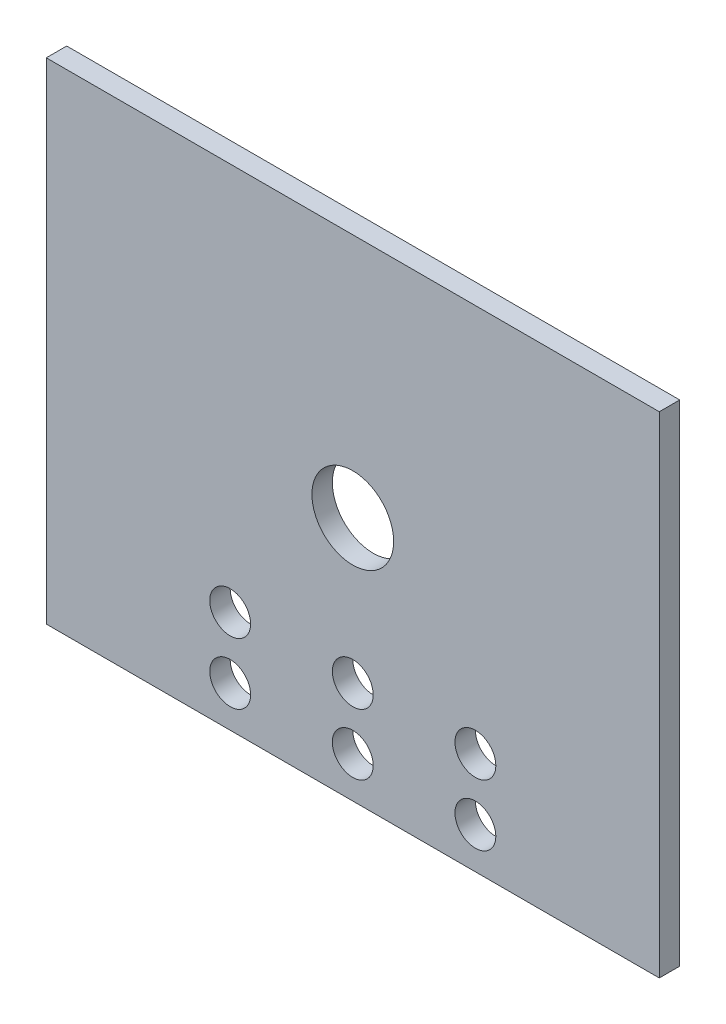
ISO-10303-21;
HEADER;
FILE_DESCRIPTION(('STEP AP214'),'2;1');
FILE_NAME('part.step','',(''),(''),'','','');
FILE_SCHEMA(('AUTOMOTIVE_DESIGN { 1 0 10303 214 1 1 1 1 }'));
ENDSEC;
DATA;
#1=APPLICATION_CONTEXT('core data for automotive mechanical design processes');
#2=APPLICATION_PROTOCOL_DEFINITION('international standard','automotive_design',2000,#1);
#3=PRODUCT_CONTEXT('',#1,'mechanical');
#4=PRODUCT('Part','Part','',(#3));
#5=PRODUCT_RELATED_PRODUCT_CATEGORY('part','',(#4));
#6=PRODUCT_DEFINITION_FORMATION('','',#4);
#7=PRODUCT_DEFINITION_CONTEXT('part definition',#1,'design');
#8=PRODUCT_DEFINITION('design','',#6,#7);
#9=PRODUCT_DEFINITION_SHAPE('','',#8);
#10=(LENGTH_UNIT() NAMED_UNIT(*) SI_UNIT(.MILLI.,.METRE.));
#11=(NAMED_UNIT(*) PLANE_ANGLE_UNIT() SI_UNIT($,.RADIAN.));
#12=(NAMED_UNIT(*) SI_UNIT($,.STERADIAN.) SOLID_ANGLE_UNIT());
#13=UNCERTAINTY_MEASURE_WITH_UNIT(LENGTH_MEASURE(1.E-05),#10,'distance_accuracy_value','');
#14=(GEOMETRIC_REPRESENTATION_CONTEXT(3) GLOBAL_UNCERTAINTY_ASSIGNED_CONTEXT((#13)) GLOBAL_UNIT_ASSIGNED_CONTEXT((#10,
#11,#12)) REPRESENTATION_CONTEXT('',''));
#15=CARTESIAN_POINT('',(0.,0.,0.));
#16=DIRECTION('',(0.,0.,1.));
#17=DIRECTION('',(1.,0.,0.));
#18=AXIS2_PLACEMENT_3D('',#15,#16,#17);
#19=CARTESIAN_POINT('',(0.,0.,5.));
#20=DIRECTION('',(1.,0.,0.));
#21=DIRECTION('',(0.,0.,-1.));
#22=AXIS2_PLACEMENT_3D('',#19,#20,#21);
#23=PLANE('',#22);
#24=DIRECTION('',(0.,-1.,0.));
#25=VECTOR('',#24,1.);
#26=CARTESIAN_POINT('',(0.,0.,0.));
#27=LINE('',#26,#25);
#28=CARTESIAN_POINT('',(0.,120.,0.));
#29=VERTEX_POINT('',#28);
#30=CARTESIAN_POINT('',(0.,0.,0.));
#31=VERTEX_POINT('',#30);
#32=EDGE_CURVE('E398',#29,#31,#27,.T.);
#33=ORIENTED_EDGE('',*,*,#32,.T.);
#34=DIRECTION('',(0.,0.,-1.));
#35=VECTOR('',#34,1.);
#36=CARTESIAN_POINT('',(0.,0.,5.));
#37=LINE('',#36,#35);
#38=CARTESIAN_POINT('',(0.,0.,5.));
#39=VERTEX_POINT('',#38);
#40=EDGE_CURVE('E405',#39,#31,#37,.T.);
#41=ORIENTED_EDGE('',*,*,#40,.F.);
#42=DIRECTION('',(0.,-1.,0.));
#43=VECTOR('',#42,1.);
#44=CARTESIAN_POINT('',(0.,0.,5.));
#45=LINE('',#44,#43);
#46=CARTESIAN_POINT('',(0.,120.,5.));
#47=VERTEX_POINT('',#46);
#48=EDGE_CURVE('E425',#47,#39,#45,.T.);
#49=ORIENTED_EDGE('',*,*,#48,.F.);
#50=DIRECTION('',(0.,0.,-1.));
#51=VECTOR('',#50,1.);
#52=CARTESIAN_POINT('',(0.,120.,5.));
#53=LINE('',#52,#51);
#54=EDGE_CURVE('E413',#47,#29,#53,.T.);
#55=ORIENTED_EDGE('',*,*,#54,.T.);
#56=EDGE_LOOP('',(#33,#41,#49,#55));
#57=FACE_BOUND('',#56,.T.);
#58=ADVANCED_FACE('F349',(#57),#23,.F.);
#59=CARTESIAN_POINT('',(0.,0.,5.));
#60=DIRECTION('',(0.,1.,0.));
#61=DIRECTION('',(0.,0.,1.));
#62=AXIS2_PLACEMENT_3D('',#59,#60,#61);
#63=PLANE('',#62);
#64=DIRECTION('',(1.,0.,0.));
#65=VECTOR('',#64,1.);
#66=CARTESIAN_POINT('',(0.,0.,0.));
#67=LINE('',#66,#65);
#68=CARTESIAN_POINT('',(150.,0.,0.));
#69=VERTEX_POINT('',#68);
#70=EDGE_CURVE('E392',#31,#69,#67,.T.);
#71=ORIENTED_EDGE('',*,*,#70,.T.);
#72=DIRECTION('',(0.,0.,-1.));
#73=VECTOR('',#72,1.);
#74=CARTESIAN_POINT('',(150.,0.,5.));
#75=LINE('',#74,#73);
#76=CARTESIAN_POINT('',(150.,0.,5.));
#77=VERTEX_POINT('',#76);
#78=EDGE_CURVE('E410',#77,#69,#75,.T.);
#79=ORIENTED_EDGE('',*,*,#78,.F.);
#80=DIRECTION('',(1.,0.,0.));
#81=VECTOR('',#80,1.);
#82=CARTESIAN_POINT('',(0.,0.,5.));
#83=LINE('',#82,#81);
#84=EDGE_CURVE('E407',#39,#77,#83,.T.);
#85=ORIENTED_EDGE('',*,*,#84,.F.);
#86=ORIENTED_EDGE('',*,*,#40,.T.);
#87=EDGE_LOOP('',(#71,#79,#85,#86));
#88=FACE_BOUND('',#87,.T.);
#89=ADVANCED_FACE('F406',(#88),#63,.F.);
#90=CARTESIAN_POINT('',(150.,0.,5.));
#91=DIRECTION('',(-1.,0.,0.));
#92=DIRECTION('',(0.,0.,1.));
#93=AXIS2_PLACEMENT_3D('',#90,#91,#92);
#94=PLANE('',#93);
#95=DIRECTION('',(0.,1.,0.));
#96=VECTOR('',#95,1.);
#97=CARTESIAN_POINT('',(150.,0.,0.));
#98=LINE('',#97,#96);
#99=CARTESIAN_POINT('',(150.,120.,0.));
#100=VERTEX_POINT('',#99);
#101=EDGE_CURVE('E399',#69,#100,#98,.T.);
#102=ORIENTED_EDGE('',*,*,#101,.T.);
#103=DIRECTION('',(0.,0.,-1.));
#104=VECTOR('',#103,1.);
#105=CARTESIAN_POINT('',(150.,120.,5.));
#106=LINE('',#105,#104);
#107=CARTESIAN_POINT('',(150.,120.,5.));
#108=VERTEX_POINT('',#107);
#109=EDGE_CURVE('E431',#108,#100,#106,.T.);
#110=ORIENTED_EDGE('',*,*,#109,.F.);
#111=DIRECTION('',(0.,1.,0.));
#112=VECTOR('',#111,1.);
#113=CARTESIAN_POINT('',(150.,0.,5.));
#114=LINE('',#113,#112);
#115=EDGE_CURVE('E371',#77,#108,#114,.T.);
#116=ORIENTED_EDGE('',*,*,#115,.F.);
#117=ORIENTED_EDGE('',*,*,#78,.T.);
#118=EDGE_LOOP('',(#102,#110,#116,#117));
#119=FACE_BOUND('',#118,.T.);
#120=ADVANCED_FACE('F497',(#119),#94,.F.);
#121=CARTESIAN_POINT('',(0.,120.,5.));
#122=DIRECTION('',(0.,-1.,0.));
#123=DIRECTION('',(0.,0.,-1.));
#124=AXIS2_PLACEMENT_3D('',#121,#122,#123);
#125=PLANE('',#124);
#126=DIRECTION('',(-1.,0.,0.));
#127=VECTOR('',#126,1.);
#128=CARTESIAN_POINT('',(0.,120.,0.));
#129=LINE('',#128,#127);
#130=EDGE_CURVE('E423',#100,#29,#129,.T.);
#131=ORIENTED_EDGE('',*,*,#130,.T.);
#132=ORIENTED_EDGE('',*,*,#54,.F.);
#133=DIRECTION('',(-1.,0.,0.));
#134=VECTOR('',#133,1.);
#135=CARTESIAN_POINT('',(0.,120.,5.));
#136=LINE('',#135,#134);
#137=EDGE_CURVE('E366',#108,#47,#136,.T.);
#138=ORIENTED_EDGE('',*,*,#137,.F.);
#139=ORIENTED_EDGE('',*,*,#109,.T.);
#140=EDGE_LOOP('',(#131,#132,#138,#139));
#141=FACE_BOUND('',#140,.T.);
#142=ADVANCED_FACE('F472',(#141),#125,.F.);
#143=CARTESIAN_POINT('',(0.,120.,5.));
#144=DIRECTION('',(0.,0.,-1.));
#145=DIRECTION('',(-1.,0.,0.));
#146=AXIS2_PLACEMENT_3D('',#143,#144,#145);
#147=PLANE('',#146);
#148=CARTESIAN_POINT('',(105.,25.,5.));
#149=DIRECTION('',(0.,0.,1.));
#150=DIRECTION('',(1.,0.,0.));
#151=AXIS2_PLACEMENT_3D('',#148,#149,#150);
#152=CIRCLE('',#151,5.);
#153=CARTESIAN_POINT('',(110.,25.,5.));
#154=VERTEX_POINT('',#153);
#155=EDGE_CURVE('E457',#154,#154,#152,.T.);
#156=ORIENTED_EDGE('',*,*,#155,.F.);
#157=EDGE_LOOP('',(#156));
#158=FACE_BOUND('',#157,.T.);
#159=CARTESIAN_POINT('',(75.,25.,5.));
#160=DIRECTION('',(0.,0.,1.));
#161=DIRECTION('',(1.,0.,0.));
#162=AXIS2_PLACEMENT_3D('',#159,#160,#161);
#163=CIRCLE('',#162,5.);
#164=CARTESIAN_POINT('',(80.,25.,5.));
#165=VERTEX_POINT('',#164);
#166=EDGE_CURVE('E447',#165,#165,#163,.T.);
#167=ORIENTED_EDGE('',*,*,#166,.F.);
#168=EDGE_LOOP('',(#167));
#169=FACE_BOUND('',#168,.T.);
#170=CARTESIAN_POINT('',(45.,25.,5.));
#171=DIRECTION('',(0.,0.,1.));
#172=DIRECTION('',(1.,0.,0.));
#173=AXIS2_PLACEMENT_3D('',#170,#171,#172);
#174=CIRCLE('',#173,5.);
#175=CARTESIAN_POINT('',(50.,25.,5.));
#176=VERTEX_POINT('',#175);
#177=EDGE_CURVE('E444',#176,#176,#174,.T.);
#178=ORIENTED_EDGE('',*,*,#177,.F.);
#179=EDGE_LOOP('',(#178));
#180=FACE_BOUND('',#179,.T.);
#181=CARTESIAN_POINT('',(75.,9.99999999999999,5.));
#182=DIRECTION('',(0.,0.,1.));
#183=DIRECTION('',(1.,0.,0.));
#184=AXIS2_PLACEMENT_3D('',#181,#182,#183);
#185=CIRCLE('',#184,5.);
#186=CARTESIAN_POINT('',(80.,9.99999999999999,5.));
#187=VERTEX_POINT('',#186);
#188=EDGE_CURVE('E462',#187,#187,#185,.T.);
#189=ORIENTED_EDGE('',*,*,#188,.F.);
#190=EDGE_LOOP('',(#189));
#191=FACE_BOUND('',#190,.T.);
#192=CARTESIAN_POINT('',(45.,9.99999999999999,5.));
#193=DIRECTION('',(0.,0.,1.));
#194=DIRECTION('',(1.,0.,0.));
#195=AXIS2_PLACEMENT_3D('',#192,#193,#194);
#196=CIRCLE('',#195,5.);
#197=CARTESIAN_POINT('',(50.,9.99999999999999,5.));
#198=VERTEX_POINT('',#197);
#199=EDGE_CURVE('E438',#198,#198,#196,.T.);
#200=ORIENTED_EDGE('',*,*,#199,.F.);
#201=EDGE_LOOP('',(#200));
#202=FACE_BOUND('',#201,.T.);
#203=CARTESIAN_POINT('',(75.,60.,5.));
#204=DIRECTION('',(0.,0.,1.));
#205=DIRECTION('',(1.,0.,0.));
#206=AXIS2_PLACEMENT_3D('',#203,#204,#205);
#207=CIRCLE('',#206,9.99999999999999);
#208=CARTESIAN_POINT('',(85.,60.,5.));
#209=VERTEX_POINT('',#208);
#210=EDGE_CURVE('E417',#209,#209,#207,.T.);
#211=ORIENTED_EDGE('',*,*,#210,.F.);
#212=EDGE_LOOP('',(#211));
#213=FACE_BOUND('',#212,.T.);
#214=ORIENTED_EDGE('',*,*,#48,.T.);
#215=ORIENTED_EDGE('',*,*,#84,.T.);
#216=ORIENTED_EDGE('',*,*,#115,.T.);
#217=ORIENTED_EDGE('',*,*,#137,.T.);
#218=EDGE_LOOP('',(#214,#215,#216,#217));
#219=FACE_BOUND('',#218,.T.);
#220=CARTESIAN_POINT('',(105.,9.99999999999999,5.));
#221=DIRECTION('',(0.,0.,1.));
#222=DIRECTION('',(1.,0.,0.));
#223=AXIS2_PLACEMENT_3D('',#220,#221,#222);
#224=CIRCLE('',#223,5.);
#225=CARTESIAN_POINT('',(110.,9.99999999999999,5.));
#226=VERTEX_POINT('',#225);
#227=EDGE_CURVE('E11',#226,#226,#224,.T.);
#228=ORIENTED_EDGE('',*,*,#227,.F.);
#229=EDGE_LOOP('',(#228));
#230=FACE_BOUND('',#229,.T.);
#231=ADVANCED_FACE('F469',(#158,#169,#180,#191,#202,#213,#219,#230),#147,.F.);
#232=CARTESIAN_POINT('',(0.,120.,0.));
#233=DIRECTION('',(0.,0.,-1.));
#234=DIRECTION('',(-1.,0.,0.));
#235=AXIS2_PLACEMENT_3D('',#232,#233,#234);
#236=PLANE('',#235);
#237=CARTESIAN_POINT('',(105.,25.,0.));
#238=DIRECTION('',(0.,0.,-1.));
#239=DIRECTION('',(-1.,0.,0.));
#240=AXIS2_PLACEMENT_3D('',#237,#238,#239);
#241=CIRCLE('',#240,5.);
#242=CARTESIAN_POINT('',(100.,25.,0.));
#243=VERTEX_POINT('',#242);
#244=EDGE_CURVE('E353',#243,#243,#241,.T.);
#245=ORIENTED_EDGE('',*,*,#244,.F.);
#246=EDGE_LOOP('',(#245));
#247=FACE_BOUND('',#246,.T.);
#248=CARTESIAN_POINT('',(75.,25.,0.));
#249=DIRECTION('',(0.,0.,-1.));
#250=DIRECTION('',(-1.,0.,0.));
#251=AXIS2_PLACEMENT_3D('',#248,#249,#250);
#252=CIRCLE('',#251,5.);
#253=CARTESIAN_POINT('',(70.,25.,0.));
#254=VERTEX_POINT('',#253);
#255=EDGE_CURVE('E445',#254,#254,#252,.T.);
#256=ORIENTED_EDGE('',*,*,#255,.F.);
#257=EDGE_LOOP('',(#256));
#258=FACE_BOUND('',#257,.T.);
#259=CARTESIAN_POINT('',(45.,25.,0.));
#260=DIRECTION('',(0.,0.,-1.));
#261=DIRECTION('',(-1.,0.,0.));
#262=AXIS2_PLACEMENT_3D('',#259,#260,#261);
#263=CIRCLE('',#262,5.);
#264=CARTESIAN_POINT('',(40.,25.,0.));
#265=VERTEX_POINT('',#264);
#266=EDGE_CURVE('E441',#265,#265,#263,.T.);
#267=ORIENTED_EDGE('',*,*,#266,.F.);
#268=EDGE_LOOP('',(#267));
#269=FACE_BOUND('',#268,.T.);
#270=CARTESIAN_POINT('',(75.,9.99999999999999,0.));
#271=DIRECTION('',(0.,0.,-1.));
#272=DIRECTION('',(-1.,0.,0.));
#273=AXIS2_PLACEMENT_3D('',#270,#271,#272);
#274=CIRCLE('',#273,5.);
#275=CARTESIAN_POINT('',(70.,9.99999999999999,0.));
#276=VERTEX_POINT('',#275);
#277=EDGE_CURVE('E443',#276,#276,#274,.T.);
#278=ORIENTED_EDGE('',*,*,#277,.F.);
#279=EDGE_LOOP('',(#278));
#280=FACE_BOUND('',#279,.T.);
#281=CARTESIAN_POINT('',(45.,9.99999999999999,0.));
#282=DIRECTION('',(0.,0.,-1.));
#283=DIRECTION('',(-1.,0.,0.));
#284=AXIS2_PLACEMENT_3D('',#281,#282,#283);
#285=CIRCLE('',#284,5.);
#286=CARTESIAN_POINT('',(40.,9.99999999999999,0.));
#287=VERTEX_POINT('',#286);
#288=EDGE_CURVE('E435',#287,#287,#285,.T.);
#289=ORIENTED_EDGE('',*,*,#288,.F.);
#290=EDGE_LOOP('',(#289));
#291=FACE_BOUND('',#290,.T.);
#292=CARTESIAN_POINT('',(75.,60.,0.));
#293=DIRECTION('',(0.,0.,-1.));
#294=DIRECTION('',(-1.,0.,0.));
#295=AXIS2_PLACEMENT_3D('',#292,#293,#294);
#296=CIRCLE('',#295,9.99999999999999);
#297=CARTESIAN_POINT('',(65.,60.,0.));
#298=VERTEX_POINT('',#297);
#299=EDGE_CURVE('E414',#298,#298,#296,.T.);
#300=ORIENTED_EDGE('',*,*,#299,.F.);
#301=EDGE_LOOP('',(#300));
#302=FACE_BOUND('',#301,.T.);
#303=ORIENTED_EDGE('',*,*,#32,.F.);
#304=ORIENTED_EDGE('',*,*,#130,.F.);
#305=ORIENTED_EDGE('',*,*,#101,.F.);
#306=ORIENTED_EDGE('',*,*,#70,.F.);
#307=EDGE_LOOP('',(#303,#304,#305,#306));
#308=FACE_BOUND('',#307,.T.);
#309=CARTESIAN_POINT('',(105.,9.99999999999999,0.));
#310=DIRECTION('',(0.,0.,-1.));
#311=DIRECTION('',(-1.,0.,0.));
#312=AXIS2_PLACEMENT_3D('',#309,#310,#311);
#313=CIRCLE('',#312,5.);
#314=CARTESIAN_POINT('',(100.,9.99999999999999,0.));
#315=VERTEX_POINT('',#314);
#316=EDGE_CURVE('E358',#315,#315,#313,.T.);
#317=ORIENTED_EDGE('',*,*,#316,.F.);
#318=EDGE_LOOP('',(#317));
#319=FACE_BOUND('',#318,.T.);
#320=ADVANCED_FACE('F394',(#247,#258,#269,#280,#291,#302,#308,#319),#236,.T.);
#321=CARTESIAN_POINT('',(75.,60.,-5.));
#322=DIRECTION('',(0.,0.,1.));
#323=DIRECTION('',(1.,0.,0.));
#324=AXIS2_PLACEMENT_3D('',#321,#322,#323);
#325=CYLINDRICAL_SURFACE('',#324,9.99999999999999);
#326=ORIENTED_EDGE('',*,*,#299,.T.);
#327=EDGE_LOOP('',(#326));
#328=FACE_BOUND('',#327,.T.);
#329=ORIENTED_EDGE('',*,*,#210,.T.);
#330=EDGE_LOOP('',(#329));
#331=FACE_BOUND('',#330,.T.);
#332=ADVANCED_FACE('F508',(#328,#331),#325,.F.);
#333=CARTESIAN_POINT('',(45.,9.99999999999999,-5.));
#334=DIRECTION('',(0.,0.,1.));
#335=DIRECTION('',(1.,0.,0.));
#336=AXIS2_PLACEMENT_3D('',#333,#334,#335);
#337=CYLINDRICAL_SURFACE('',#336,5.);
#338=ORIENTED_EDGE('',*,*,#288,.T.);
#339=EDGE_LOOP('',(#338));
#340=FACE_BOUND('',#339,.T.);
#341=ORIENTED_EDGE('',*,*,#199,.T.);
#342=EDGE_LOOP('',(#341));
#343=FACE_BOUND('',#342,.T.);
#344=ADVANCED_FACE('F467',(#340,#343),#337,.F.);
#345=CARTESIAN_POINT('',(75.,9.99999999999999,-5.));
#346=DIRECTION('',(0.,0.,1.));
#347=DIRECTION('',(1.,0.,0.));
#348=AXIS2_PLACEMENT_3D('',#345,#346,#347);
#349=CYLINDRICAL_SURFACE('',#348,5.);
#350=ORIENTED_EDGE('',*,*,#277,.T.);
#351=EDGE_LOOP('',(#350));
#352=FACE_BOUND('',#351,.T.);
#353=ORIENTED_EDGE('',*,*,#188,.T.);
#354=EDGE_LOOP('',(#353));
#355=FACE_BOUND('',#354,.T.);
#356=ADVANCED_FACE('F482',(#352,#355),#349,.F.);
#357=CARTESIAN_POINT('',(105.,9.99999999999999,-5.));
#358=DIRECTION('',(0.,0.,1.));
#359=DIRECTION('',(1.,0.,0.));
#360=AXIS2_PLACEMENT_3D('',#357,#358,#359);
#361=CYLINDRICAL_SURFACE('',#360,5.);
#362=ORIENTED_EDGE('',*,*,#316,.T.);
#363=EDGE_LOOP('',(#362));
#364=FACE_BOUND('',#363,.T.);
#365=ORIENTED_EDGE('',*,*,#227,.T.);
#366=EDGE_LOOP('',(#365));
#367=FACE_BOUND('',#366,.T.);
#368=ADVANCED_FACE('F351',(#364,#367),#361,.F.);
#369=CARTESIAN_POINT('',(45.,25.,-5.));
#370=DIRECTION('',(0.,0.,1.));
#371=DIRECTION('',(1.,0.,0.));
#372=AXIS2_PLACEMENT_3D('',#369,#370,#371);
#373=CYLINDRICAL_SURFACE('',#372,5.);
#374=ORIENTED_EDGE('',*,*,#266,.T.);
#375=EDGE_LOOP('',(#374));
#376=FACE_BOUND('',#375,.T.);
#377=ORIENTED_EDGE('',*,*,#177,.T.);
#378=EDGE_LOOP('',(#377));
#379=FACE_BOUND('',#378,.T.);
#380=ADVANCED_FACE('F481',(#376,#379),#373,.F.);
#381=CARTESIAN_POINT('',(75.,25.,-5.));
#382=DIRECTION('',(0.,0.,1.));
#383=DIRECTION('',(1.,0.,0.));
#384=AXIS2_PLACEMENT_3D('',#381,#382,#383);
#385=CYLINDRICAL_SURFACE('',#384,5.);
#386=ORIENTED_EDGE('',*,*,#255,.T.);
#387=EDGE_LOOP('',(#386));
#388=FACE_BOUND('',#387,.T.);
#389=ORIENTED_EDGE('',*,*,#166,.T.);
#390=EDGE_LOOP('',(#389));
#391=FACE_BOUND('',#390,.T.);
#392=ADVANCED_FACE('F488',(#388,#391),#385,.F.);
#393=CARTESIAN_POINT('',(105.,25.,-5.));
#394=DIRECTION('',(0.,0.,1.));
#395=DIRECTION('',(1.,0.,0.));
#396=AXIS2_PLACEMENT_3D('',#393,#394,#395);
#397=CYLINDRICAL_SURFACE('',#396,5.);
#398=ORIENTED_EDGE('',*,*,#244,.T.);
#399=EDGE_LOOP('',(#398));
#400=FACE_BOUND('',#399,.T.);
#401=ORIENTED_EDGE('',*,*,#155,.T.);
#402=EDGE_LOOP('',(#401));
#403=FACE_BOUND('',#402,.T.);
#404=ADVANCED_FACE('F518',(#400,#403),#397,.F.);
#405=CLOSED_SHELL('',(#58,#89,#120,#142,#231,#320,#332,#344,#356,#368,#380,#392,#404));
#406=MANIFOLD_SOLID_BREP('B2',#405);
#407=ADVANCED_BREP_SHAPE_REPRESENTATION('',(#18,#406),#14);
#408=SHAPE_DEFINITION_REPRESENTATION(#9,#407);
ENDSEC;
END-ISO-10303-21;
